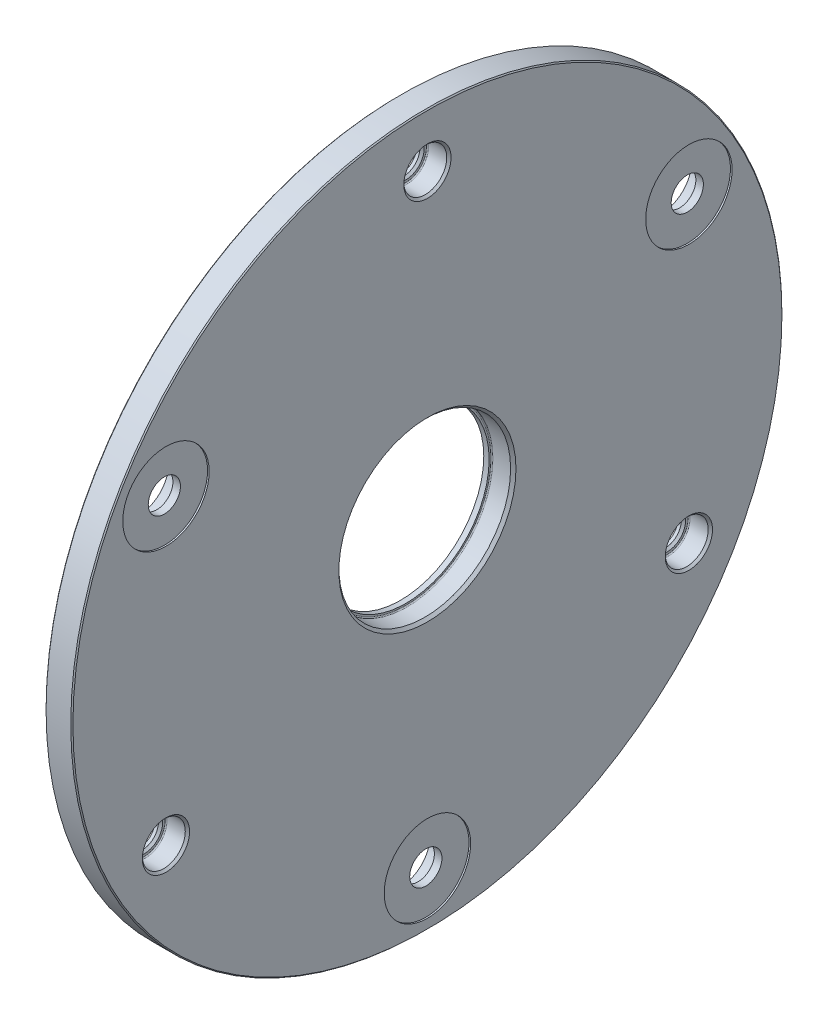
ISO-10303-21;
HEADER;
FILE_DESCRIPTION(('STEP AP214'),'2;1');
FILE_NAME('part.step','',(''),(''),'','','');
FILE_SCHEMA(('AUTOMOTIVE_DESIGN { 1 0 10303 214 1 1 1 1 }'));
ENDSEC;
DATA;
#1=APPLICATION_CONTEXT('core data for automotive mechanical design processes');
#2=APPLICATION_PROTOCOL_DEFINITION('international standard','automotive_design',2000,#1);
#3=PRODUCT_CONTEXT('',#1,'mechanical');
#4=PRODUCT('Part','Part','',(#3));
#5=PRODUCT_RELATED_PRODUCT_CATEGORY('part','',(#4));
#6=PRODUCT_DEFINITION_FORMATION('','',#4);
#7=PRODUCT_DEFINITION_CONTEXT('part definition',#1,'design');
#8=PRODUCT_DEFINITION('design','',#6,#7);
#9=PRODUCT_DEFINITION_SHAPE('','',#8);
#10=(LENGTH_UNIT() NAMED_UNIT(*) SI_UNIT(.MILLI.,.METRE.));
#11=(NAMED_UNIT(*) PLANE_ANGLE_UNIT() SI_UNIT($,.RADIAN.));
#12=(NAMED_UNIT(*) SI_UNIT($,.STERADIAN.) SOLID_ANGLE_UNIT());
#13=UNCERTAINTY_MEASURE_WITH_UNIT(LENGTH_MEASURE(1.E-05),#10,'distance_accuracy_value','');
#14=(GEOMETRIC_REPRESENTATION_CONTEXT(3) GLOBAL_UNCERTAINTY_ASSIGNED_CONTEXT((#13)) GLOBAL_UNIT_ASSIGNED_CONTEXT((#10,
#11,#12)) REPRESENTATION_CONTEXT('',''));
#15=CARTESIAN_POINT('',(0.,0.,0.));
#16=DIRECTION('',(0.,0.,1.));
#17=DIRECTION('',(1.,0.,0.));
#18=AXIS2_PLACEMENT_3D('',#15,#16,#17);
#19=CARTESIAN_POINT('',(-13.4852813742386,-28.1249999999995,48.7139289628749));
#20=DIRECTION('',(1.,0.,0.));
#21=DIRECTION('',(0.,0.,-1.));
#22=AXIS2_PLACEMENT_3D('',#19,#20,#21);
#23=CYLINDRICAL_SURFACE('',#22,3.);
#24=CARTESIAN_POINT('',(-4.39999999999994,-28.1249999999995,48.7139289628749));
#25=DIRECTION('',(1.,0.,0.));
#26=DIRECTION('',(0.,0.,-1.));
#27=AXIS2_PLACEMENT_3D('',#24,#25,#26);
#28=CIRCLE('',#27,3.);
#29=CARTESIAN_POINT('',(-4.39999999999994,-28.1249999999995,45.7139289628749));
#30=VERTEX_POINT('',#29);
#31=EDGE_CURVE('E95',#30,#30,#28,.T.);
#32=ORIENTED_EDGE('',*,*,#31,.T.);
#33=EDGE_LOOP('',(#32));
#34=FACE_BOUND('',#33,.T.);
#35=CARTESIAN_POINT('',(-5.,-28.1249999999995,48.7139289628749));
#36=DIRECTION('',(1.,0.,0.));
#37=DIRECTION('',(0.,0.,-1.));
#38=AXIS2_PLACEMENT_3D('',#35,#36,#37);
#39=CIRCLE('',#38,3.);
#40=CARTESIAN_POINT('',(-5.,-28.1249999999995,45.7139289628749));
#41=VERTEX_POINT('',#40);
#42=EDGE_CURVE('E153',#41,#41,#39,.F.);
#43=ORIENTED_EDGE('',*,*,#42,.T.);
#44=EDGE_LOOP('',(#43));
#45=FACE_BOUND('',#44,.T.);
#46=ADVANCED_FACE('F34',(#34,#45),#23,.F.);
#47=CARTESIAN_POINT('',(-13.4852813742386,-28.1250000000002,-48.7139289628746));
#48=DIRECTION('',(1.,0.,0.));
#49=DIRECTION('',(0.,0.,-1.));
#50=AXIS2_PLACEMENT_3D('',#47,#48,#49);
#51=CYLINDRICAL_SURFACE('',#50,3.);
#52=CARTESIAN_POINT('',(-4.39999999999994,-28.1250000000002,-48.7139289628746));
#53=DIRECTION('',(1.,0.,0.));
#54=DIRECTION('',(0.,0.,-1.));
#55=AXIS2_PLACEMENT_3D('',#52,#53,#54);
#56=CIRCLE('',#55,3.);
#57=CARTESIAN_POINT('',(-4.39999999999994,-28.1250000000002,-51.7139289628746));
#58=VERTEX_POINT('',#57);
#59=EDGE_CURVE('E107',#58,#58,#56,.T.);
#60=ORIENTED_EDGE('',*,*,#59,.T.);
#61=EDGE_LOOP('',(#60));
#62=FACE_BOUND('',#61,.T.);
#63=CARTESIAN_POINT('',(-5.,-28.1250000000002,-48.7139289628746));
#64=DIRECTION('',(1.,0.,0.));
#65=DIRECTION('',(0.,0.,-1.));
#66=AXIS2_PLACEMENT_3D('',#63,#64,#65);
#67=CIRCLE('',#66,3.);
#68=CARTESIAN_POINT('',(-5.,-28.1250000000002,-51.7139289628746));
#69=VERTEX_POINT('',#68);
#70=EDGE_CURVE('E152',#69,#69,#67,.F.);
#71=ORIENTED_EDGE('',*,*,#70,.T.);
#72=EDGE_LOOP('',(#71));
#73=FACE_BOUND('',#72,.T.);
#74=ADVANCED_FACE('F209',(#62,#73),#51,.F.);
#75=CARTESIAN_POINT('',(-13.4852813742386,56.25,0.));
#76=DIRECTION('',(1.,0.,0.));
#77=DIRECTION('',(0.,0.,-1.));
#78=AXIS2_PLACEMENT_3D('',#75,#76,#77);
#79=CYLINDRICAL_SURFACE('',#78,3.);
#80=CARTESIAN_POINT('',(-4.39999999999998,56.25,0.));
#81=DIRECTION('',(1.,0.,0.));
#82=DIRECTION('',(0.,0.,-1.));
#83=AXIS2_PLACEMENT_3D('',#80,#81,#82);
#84=CIRCLE('',#83,3.);
#85=CARTESIAN_POINT('',(-4.39999999999998,56.25,-3.));
#86=VERTEX_POINT('',#85);
#87=EDGE_CURVE('E130',#86,#86,#84,.T.);
#88=ORIENTED_EDGE('',*,*,#87,.T.);
#89=EDGE_LOOP('',(#88));
#90=FACE_BOUND('',#89,.T.);
#91=CARTESIAN_POINT('',(-5.,56.25,0.));
#92=DIRECTION('',(1.,0.,0.));
#93=DIRECTION('',(0.,0.,-1.));
#94=AXIS2_PLACEMENT_3D('',#91,#92,#93);
#95=CIRCLE('',#94,3.);
#96=CARTESIAN_POINT('',(-5.,56.25,-3.));
#97=VERTEX_POINT('',#96);
#98=EDGE_CURVE('E136',#97,#97,#95,.F.);
#99=ORIENTED_EDGE('',*,*,#98,.T.);
#100=EDGE_LOOP('',(#99));
#101=FACE_BOUND('',#100,.T.);
#102=ADVANCED_FACE('F215',(#90,#101),#79,.F.);
#103=CARTESIAN_POINT('',(-5.,0.,0.));
#104=DIRECTION('',(1.,0.,0.));
#105=DIRECTION('',(0.,0.,-1.));
#106=AXIS2_PLACEMENT_3D('',#103,#104,#105);
#107=CYLINDRICAL_SURFACE('',#106,66.25);
#108=CARTESIAN_POINT('',(-0.20000000000002,0.,0.));
#109=DIRECTION('',(1.,0.,0.));
#110=DIRECTION('',(0.,0.,-1.));
#111=AXIS2_PLACEMENT_3D('',#108,#109,#110);
#112=CIRCLE('',#111,66.25);
#113=CARTESIAN_POINT('',(-0.20000000000002,0.,-66.25));
#114=VERTEX_POINT('',#113);
#115=EDGE_CURVE('E42',#114,#114,#112,.F.);
#116=ORIENTED_EDGE('',*,*,#115,.T.);
#117=EDGE_LOOP('',(#116));
#118=FACE_BOUND('',#117,.T.);
#119=CARTESIAN_POINT('',(-4.80000000000001,0.,0.));
#120=DIRECTION('',(1.,0.,0.));
#121=DIRECTION('',(0.,0.,-1.));
#122=AXIS2_PLACEMENT_3D('',#119,#120,#121);
#123=CIRCLE('',#122,66.25);
#124=CARTESIAN_POINT('',(-4.80000000000001,0.,-66.25));
#125=VERTEX_POINT('',#124);
#126=EDGE_CURVE('E46',#125,#125,#123,.T.);
#127=ORIENTED_EDGE('',*,*,#126,.T.);
#128=EDGE_LOOP('',(#127));
#129=FACE_BOUND('',#128,.T.);
#130=ADVANCED_FACE('F255',(#118,#129),#107,.T.);
#131=CARTESIAN_POINT('',(-5.,0.,0.));
#132=DIRECTION('',(1.,0.,0.));
#133=DIRECTION('',(0.,0.,-1.));
#134=AXIS2_PLACEMENT_3D('',#131,#132,#133);
#135=PLANE('',#134);
#136=CARTESIAN_POINT('',(-5.,0.,0.));
#137=DIRECTION('',(1.,0.,0.));
#138=DIRECTION('',(0.,0.,-1.));
#139=AXIS2_PLACEMENT_3D('',#136,#137,#138);
#140=CIRCLE('',#139,66.05);
#141=CARTESIAN_POINT('',(-5.,0.,-66.05));
#142=VERTEX_POINT('',#141);
#143=EDGE_CURVE('E11',#142,#142,#140,.F.);
#144=ORIENTED_EDGE('',*,*,#143,.T.);
#145=EDGE_LOOP('',(#144));
#146=FACE_BOUND('',#145,.T.);
#147=CARTESIAN_POINT('',(-5.,28.1250000000004,48.7139289628745));
#148=DIRECTION('',(-1.,0.,0.));
#149=DIRECTION('',(0.,0.,1.));
#150=AXIS2_PLACEMENT_3D('',#147,#148,#149);
#151=CIRCLE('',#150,5.5);
#152=CARTESIAN_POINT('',(-5.,28.1250000000004,54.2139289628745));
#153=VERTEX_POINT('',#152);
#154=EDGE_CURVE('E181',#153,#153,#151,.T.);
#155=ORIENTED_EDGE('',*,*,#154,.F.);
#156=EDGE_LOOP('',(#155));
#157=FACE_BOUND('',#156,.T.);
#158=CARTESIAN_POINT('',(-5.,-56.25,1.73472347597681E-13));
#159=DIRECTION('',(-1.,0.,0.));
#160=DIRECTION('',(0.,0.,1.));
#161=AXIS2_PLACEMENT_3D('',#158,#159,#160);
#162=CIRCLE('',#161,5.5);
#163=CARTESIAN_POINT('',(-5.,-56.25,5.50000000000017));
#164=VERTEX_POINT('',#163);
#165=EDGE_CURVE('E71',#164,#164,#162,.T.);
#166=ORIENTED_EDGE('',*,*,#165,.F.);
#167=EDGE_LOOP('',(#166));
#168=FACE_BOUND('',#167,.T.);
#169=ORIENTED_EDGE('',*,*,#70,.F.);
#170=EDGE_LOOP('',(#169));
#171=FACE_BOUND('',#170,.T.);
#172=ORIENTED_EDGE('',*,*,#42,.F.);
#173=EDGE_LOOP('',(#172));
#174=FACE_BOUND('',#173,.T.);
#175=CARTESIAN_POINT('',(-5.,28.1250000000001,-48.7139289628746));
#176=DIRECTION('',(-1.,0.,0.));
#177=DIRECTION('',(0.,0.,1.));
#178=AXIS2_PLACEMENT_3D('',#175,#176,#177);
#179=CIRCLE('',#178,5.5);
#180=CARTESIAN_POINT('',(-5.,28.1250000000001,-43.2139289628746));
#181=VERTEX_POINT('',#180);
#182=EDGE_CURVE('E149',#181,#181,#179,.T.);
#183=ORIENTED_EDGE('',*,*,#182,.F.);
#184=EDGE_LOOP('',(#183));
#185=FACE_BOUND('',#184,.T.);
#186=ORIENTED_EDGE('',*,*,#98,.F.);
#187=EDGE_LOOP('',(#186));
#188=FACE_BOUND('',#187,.T.);
#189=CARTESIAN_POINT('',(-5.,0.,0.));
#190=DIRECTION('',(1.,0.,0.));
#191=DIRECTION('',(0.,0.,-1.));
#192=AXIS2_PLACEMENT_3D('',#189,#190,#191);
#193=CIRCLE('',#192,15.5);
#194=CARTESIAN_POINT('',(-5.,0.,-15.5));
#195=VERTEX_POINT('',#194);
#196=EDGE_CURVE('E185',#195,#195,#193,.T.);
#197=ORIENTED_EDGE('',*,*,#196,.T.);
#198=EDGE_LOOP('',(#197));
#199=FACE_BOUND('',#198,.T.);
#200=ADVANCED_FACE('F261',(#146,#157,#168,#171,#174,#185,#188,#199),#135,.F.);
#201=CARTESIAN_POINT('',(0.,0.,0.));
#202=DIRECTION('',(1.,0.,0.));
#203=DIRECTION('',(0.,0.,-1.));
#204=AXIS2_PLACEMENT_3D('',#201,#202,#203);
#205=PLANE('',#204);
#206=CARTESIAN_POINT('',(0.,0.,0.));
#207=DIRECTION('',(1.,0.,0.));
#208=DIRECTION('',(0.,0.,-1.));
#209=AXIS2_PLACEMENT_3D('',#206,#207,#208);
#210=CIRCLE('',#209,66.05);
#211=CARTESIAN_POINT('',(0.,0.,-66.05));
#212=VERTEX_POINT('',#211);
#213=EDGE_CURVE('E50',#212,#212,#210,.T.);
#214=ORIENTED_EDGE('',*,*,#213,.T.);
#215=EDGE_LOOP('',(#214));
#216=FACE_BOUND('',#215,.T.);
#217=CARTESIAN_POINT('',(0.,0.,0.));
#218=DIRECTION('',(1.,0.,0.));
#219=DIRECTION('',(0.,0.,-1.));
#220=AXIS2_PLACEMENT_3D('',#217,#218,#219);
#221=CIRCLE('',#220,16.5);
#222=CARTESIAN_POINT('',(0.,0.,-16.5));
#223=VERTEX_POINT('',#222);
#224=EDGE_CURVE('E55',#223,#223,#221,.F.);
#225=ORIENTED_EDGE('',*,*,#224,.T.);
#226=EDGE_LOOP('',(#225));
#227=FACE_BOUND('',#226,.T.);
#228=CARTESIAN_POINT('',(0.,-56.25,1.73472347597681E-13));
#229=DIRECTION('',(1.,0.,0.));
#230=DIRECTION('',(0.,-0.866025403784436,0.500000000000004));
#231=AXIS2_PLACEMENT_3D('',#228,#229,#230);
#232=CIRCLE('',#231,8.05000000000001);
#233=CARTESIAN_POINT('',(0.,-63.2215045004647,4.02500000000021));
#234=VERTEX_POINT('',#233);
#235=EDGE_CURVE('E164',#234,#234,#232,.T.);
#236=ORIENTED_EDGE('',*,*,#235,.F.);
#237=EDGE_LOOP('',(#236));
#238=FACE_BOUND('',#237,.T.);
#239=CARTESIAN_POINT('',(0.,28.1250000000004,48.7139289628745));
#240=DIRECTION('',(1.,0.,0.));
#241=DIRECTION('',(0.,0.866025403784443,0.499999999999992));
#242=AXIS2_PLACEMENT_3D('',#239,#240,#241);
#243=CIRCLE('',#242,8.05000000000001);
#244=CARTESIAN_POINT('',(0.,35.0965045004652,52.7389289628744));
#245=VERTEX_POINT('',#244);
#246=EDGE_CURVE('E76',#245,#245,#243,.T.);
#247=ORIENTED_EDGE('',*,*,#246,.F.);
#248=EDGE_LOOP('',(#247));
#249=FACE_BOUND('',#248,.T.);
#250=CARTESIAN_POINT('',(0.,-28.1249999999995,48.7139289628749));
#251=DIRECTION('',(1.,0.,0.));
#252=DIRECTION('',(0.,0.,-1.));
#253=AXIS2_PLACEMENT_3D('',#250,#251,#252);
#254=CIRCLE('',#253,4.39999999999999);
#255=CARTESIAN_POINT('',(0.,-28.1249999999995,44.3139289628749));
#256=VERTEX_POINT('',#255);
#257=EDGE_CURVE('E89',#256,#256,#254,.F.);
#258=ORIENTED_EDGE('',*,*,#257,.T.);
#259=EDGE_LOOP('',(#258));
#260=FACE_BOUND('',#259,.T.);
#261=CARTESIAN_POINT('',(0.,-28.1250000000002,-48.7139289628746));
#262=DIRECTION('',(1.,0.,0.));
#263=DIRECTION('',(0.,0.,-1.));
#264=AXIS2_PLACEMENT_3D('',#261,#262,#263);
#265=CIRCLE('',#264,4.39999999999994);
#266=CARTESIAN_POINT('',(0.,-28.1250000000002,-53.1139289628745));
#267=VERTEX_POINT('',#266);
#268=EDGE_CURVE('E101',#267,#267,#265,.F.);
#269=ORIENTED_EDGE('',*,*,#268,.T.);
#270=EDGE_LOOP('',(#269));
#271=FACE_BOUND('',#270,.T.);
#272=CARTESIAN_POINT('',(0.,28.1250000000001,-48.7139289628746));
#273=DIRECTION('',(1.,0.,0.));
#274=DIRECTION('',(0.,0.,-1.));
#275=AXIS2_PLACEMENT_3D('',#272,#273,#274);
#276=CIRCLE('',#275,8.05000000000001);
#277=CARTESIAN_POINT('',(0.,28.1250000000001,-56.7639289628746));
#278=VERTEX_POINT('',#277);
#279=EDGE_CURVE('E117',#278,#278,#276,.T.);
#280=ORIENTED_EDGE('',*,*,#279,.F.);
#281=EDGE_LOOP('',(#280));
#282=FACE_BOUND('',#281,.T.);
#283=CARTESIAN_POINT('',(0.,56.25,0.));
#284=DIRECTION('',(1.,0.,0.));
#285=DIRECTION('',(0.,0.,-1.));
#286=AXIS2_PLACEMENT_3D('',#283,#284,#285);
#287=CIRCLE('',#286,4.39999999999993);
#288=CARTESIAN_POINT('',(0.,56.25,-4.39999999999993));
#289=VERTEX_POINT('',#288);
#290=EDGE_CURVE('E124',#289,#289,#287,.F.);
#291=ORIENTED_EDGE('',*,*,#290,.T.);
#292=EDGE_LOOP('',(#291));
#293=FACE_BOUND('',#292,.T.);
#294=ADVANCED_FACE('F259',(#216,#227,#238,#249,#260,#271,#282,#293),#205,.T.);
#295=CARTESIAN_POINT('',(-5.,0.,0.));
#296=DIRECTION('',(1.,0.,0.));
#297=DIRECTION('',(0.,0.,-1.));
#298=AXIS2_PLACEMENT_3D('',#295,#296,#297);
#299=CYLINDRICAL_SURFACE('',#298,16.);
#300=CARTESIAN_POINT('',(-0.500000000000014,0.,0.));
#301=DIRECTION('',(1.,0.,0.));
#302=DIRECTION('',(0.,0.,-1.));
#303=AXIS2_PLACEMENT_3D('',#300,#301,#302);
#304=CIRCLE('',#303,16.);
#305=CARTESIAN_POINT('',(-0.500000000000014,0.,-16.));
#306=VERTEX_POINT('',#305);
#307=EDGE_CURVE('E58',#306,#306,#304,.T.);
#308=ORIENTED_EDGE('',*,*,#307,.T.);
#309=EDGE_LOOP('',(#308));
#310=FACE_BOUND('',#309,.T.);
#311=CARTESIAN_POINT('',(-3.8,0.,0.));
#312=DIRECTION('',(1.,0.,0.));
#313=DIRECTION('',(0.,0.,-1.));
#314=AXIS2_PLACEMENT_3D('',#311,#312,#313);
#315=CIRCLE('',#314,16.);
#316=CARTESIAN_POINT('',(-3.8,0.,-16.));
#317=VERTEX_POINT('',#316);
#318=EDGE_CURVE('E61',#317,#317,#315,.F.);
#319=ORIENTED_EDGE('',*,*,#318,.T.);
#320=EDGE_LOOP('',(#319));
#321=FACE_BOUND('',#320,.T.);
#322=ADVANCED_FACE('F251',(#310,#321),#299,.F.);
#323=CARTESIAN_POINT('',(-16.3137084989848,56.25,0.));
#324=DIRECTION('',(1.,0.,0.));
#325=DIRECTION('',(0.,0.,-1.));
#326=AXIS2_PLACEMENT_3D('',#323,#324,#325);
#327=CYLINDRICAL_SURFACE('',#326,4.);
#328=CARTESIAN_POINT('',(-3.8,56.25,0.));
#329=DIRECTION('',(1.,0.,0.));
#330=DIRECTION('',(0.,0.,-1.));
#331=AXIS2_PLACEMENT_3D('',#328,#329,#330);
#332=CIRCLE('',#331,4.);
#333=CARTESIAN_POINT('',(-3.8,56.25,-4.));
#334=VERTEX_POINT('',#333);
#335=EDGE_CURVE('E121',#334,#334,#332,.F.);
#336=ORIENTED_EDGE('',*,*,#335,.T.);
#337=EDGE_LOOP('',(#336));
#338=FACE_BOUND('',#337,.T.);
#339=CARTESIAN_POINT('',(-0.399999999999946,56.25,0.));
#340=DIRECTION('',(1.,0.,0.));
#341=DIRECTION('',(0.,0.,-1.));
#342=AXIS2_PLACEMENT_3D('',#339,#340,#341);
#343=CIRCLE('',#342,4.);
#344=CARTESIAN_POINT('',(-0.399999999999946,56.25,-4.));
#345=VERTEX_POINT('',#344);
#346=EDGE_CURVE('E127',#345,#345,#343,.T.);
#347=ORIENTED_EDGE('',*,*,#346,.T.);
#348=EDGE_LOOP('',(#347));
#349=FACE_BOUND('',#348,.T.);
#350=ADVANCED_FACE('F247',(#338,#349),#327,.F.);
#351=CARTESIAN_POINT('',(-4.,0.,0.));
#352=DIRECTION('',(1.,0.,0.));
#353=DIRECTION('',(0.,0.,-1.));
#354=AXIS2_PLACEMENT_3D('',#351,#352,#353);
#355=PLANE('',#354);
#356=CARTESIAN_POINT('',(-4.,56.25,0.));
#357=DIRECTION('',(1.,0.,0.));
#358=DIRECTION('',(0.,0.,-1.));
#359=AXIS2_PLACEMENT_3D('',#356,#357,#358);
#360=CIRCLE('',#359,3.8);
#361=CARTESIAN_POINT('',(-4.,56.25,-3.8));
#362=VERTEX_POINT('',#361);
#363=EDGE_CURVE('E113',#362,#362,#360,.T.);
#364=ORIENTED_EDGE('',*,*,#363,.T.);
#365=EDGE_LOOP('',(#364));
#366=FACE_BOUND('',#365,.T.);
#367=CARTESIAN_POINT('',(-4.,56.25,0.));
#368=DIRECTION('',(1.,0.,0.));
#369=DIRECTION('',(0.,0.,-1.));
#370=AXIS2_PLACEMENT_3D('',#367,#368,#369);
#371=CIRCLE('',#370,3.39999999999999);
#372=CARTESIAN_POINT('',(-4.,56.25,-3.39999999999999));
#373=VERTEX_POINT('',#372);
#374=EDGE_CURVE('E133',#373,#373,#371,.F.);
#375=ORIENTED_EDGE('',*,*,#374,.T.);
#376=EDGE_LOOP('',(#375));
#377=FACE_BOUND('',#376,.T.);
#378=ADVANCED_FACE('F243',(#366,#377),#355,.T.);
#379=CARTESIAN_POINT('',(-4.,56.25,0.));
#380=DIRECTION('',(1.,0.,0.));
#381=DIRECTION('',(0.,0.,-1.));
#382=AXIS2_PLACEMENT_3D('',#379,#380,#381);
#383=CONICAL_SURFACE('',#382,3.39999999999999,0.785398163397459);
#384=ORIENTED_EDGE('',*,*,#87,.F.);
#385=EDGE_LOOP('',(#384));
#386=FACE_BOUND('',#385,.T.);
#387=ORIENTED_EDGE('',*,*,#374,.F.);
#388=EDGE_LOOP('',(#387));
#389=FACE_BOUND('',#388,.T.);
#390=ADVANCED_FACE('F246',(#386,#389),#383,.F.);
#391=CARTESIAN_POINT('',(-0.399999999999946,56.25,0.));
#392=DIRECTION('',(1.,0.,0.));
#393=DIRECTION('',(0.,0.,-1.));
#394=AXIS2_PLACEMENT_3D('',#391,#392,#393);
#395=CONICAL_SURFACE('',#394,4.,0.78539816339743);
#396=ORIENTED_EDGE('',*,*,#290,.F.);
#397=EDGE_LOOP('',(#396));
#398=FACE_BOUND('',#397,.T.);
#399=ORIENTED_EDGE('',*,*,#346,.F.);
#400=EDGE_LOOP('',(#399));
#401=FACE_BOUND('',#400,.T.);
#402=ADVANCED_FACE('F275',(#398,#401),#395,.F.);
#403=CARTESIAN_POINT('',(-3.8,56.25,0.));
#404=DIRECTION('',(1.,0.,0.));
#405=DIRECTION('',(0.,0.,-1.));
#406=AXIS2_PLACEMENT_3D('',#403,#404,#405);
#407=TOROIDAL_SURFACE('',#406,3.8,0.2);
#408=ORIENTED_EDGE('',*,*,#363,.F.);
#409=EDGE_LOOP('',(#408));
#410=FACE_BOUND('',#409,.T.);
#411=ORIENTED_EDGE('',*,*,#335,.F.);
#412=EDGE_LOOP('',(#411));
#413=FACE_BOUND('',#412,.T.);
#414=ADVANCED_FACE('F241',(#410,#413),#407,.F.);
#415=CARTESIAN_POINT('',(-0.3,28.1250000000001,-48.7139289628746));
#416=DIRECTION('',(1.,0.,0.));
#417=DIRECTION('',(0.,0.,-1.));
#418=AXIS2_PLACEMENT_3D('',#415,#416,#417);
#419=CYLINDRICAL_SURFACE('',#418,8.05000000000001);
#420=CARTESIAN_POINT('',(-0.3,28.1250000000001,-48.7139289628746));
#421=DIRECTION('',(1.,0.,0.));
#422=DIRECTION('',(0.,0.,-1.));
#423=AXIS2_PLACEMENT_3D('',#420,#421,#422);
#424=CIRCLE('',#423,8.05000000000001);
#425=CARTESIAN_POINT('',(-0.3,28.1250000000001,-56.7639289628746));
#426=VERTEX_POINT('',#425);
#427=EDGE_CURVE('E139',#426,#426,#424,.T.);
#428=ORIENTED_EDGE('',*,*,#427,.F.);
#429=EDGE_LOOP('',(#428));
#430=FACE_BOUND('',#429,.T.);
#431=ORIENTED_EDGE('',*,*,#279,.T.);
#432=EDGE_LOOP('',(#431));
#433=FACE_BOUND('',#432,.T.);
#434=ADVANCED_FACE('F237',(#430,#433),#419,.F.);
#435=CARTESIAN_POINT('',(-0.3,0.,0.));
#436=DIRECTION('',(1.,0.,0.));
#437=DIRECTION('',(0.,0.,-1.));
#438=AXIS2_PLACEMENT_3D('',#435,#436,#437);
#439=PLANE('',#438);
#440=CARTESIAN_POINT('',(-0.3,28.1250000000001,-48.7139289628746));
#441=DIRECTION('',(1.,0.,0.));
#442=DIRECTION('',(0.,0.,-1.));
#443=AXIS2_PLACEMENT_3D('',#440,#441,#442);
#444=CIRCLE('',#443,3.);
#445=CARTESIAN_POINT('',(-0.3,28.1250000000001,-51.7139289628746));
#446=VERTEX_POINT('',#445);
#447=EDGE_CURVE('E114',#446,#446,#444,.T.);
#448=ORIENTED_EDGE('',*,*,#447,.F.);
#449=EDGE_LOOP('',(#448));
#450=FACE_BOUND('',#449,.T.);
#451=ORIENTED_EDGE('',*,*,#427,.T.);
#452=EDGE_LOOP('',(#451));
#453=FACE_BOUND('',#452,.T.);
#454=ADVANCED_FACE('F233',(#450,#453),#439,.T.);
#455=CARTESIAN_POINT('',(-5.,28.1250000000001,-48.7139289628746));
#456=DIRECTION('',(-1.,0.,0.));
#457=DIRECTION('',(0.,0.,1.));
#458=AXIS2_PLACEMENT_3D('',#455,#456,#457);
#459=CYLINDRICAL_SURFACE('',#458,3.);
#460=ORIENTED_EDGE('',*,*,#447,.T.);
#461=EDGE_LOOP('',(#460));
#462=FACE_BOUND('',#461,.T.);
#463=CARTESIAN_POINT('',(-1.7,28.1250000000001,-48.7139289628746));
#464=DIRECTION('',(-1.,0.,0.));
#465=DIRECTION('',(0.,0.,1.));
#466=AXIS2_PLACEMENT_3D('',#463,#464,#465);
#467=CIRCLE('',#466,3.);
#468=CARTESIAN_POINT('',(-1.7,28.1250000000001,-45.7139289628746));
#469=VERTEX_POINT('',#468);
#470=EDGE_CURVE('E118',#469,#469,#467,.T.);
#471=ORIENTED_EDGE('',*,*,#470,.T.);
#472=EDGE_LOOP('',(#471));
#473=FACE_BOUND('',#472,.T.);
#474=ADVANCED_FACE('F229',(#462,#473),#459,.F.);
#475=CARTESIAN_POINT('',(-1.7,31.1250000000001,-48.7139289628746));
#476=DIRECTION('',(1.,0.,0.));
#477=DIRECTION('',(0.,0.,-1.));
#478=AXIS2_PLACEMENT_3D('',#475,#476,#477);
#479=PLANE('',#478);
#480=ORIENTED_EDGE('',*,*,#470,.F.);
#481=EDGE_LOOP('',(#480));
#482=FACE_BOUND('',#481,.T.);
#483=CARTESIAN_POINT('',(-1.7,28.1250000000001,-48.7139289628746));
#484=DIRECTION('',(-1.,0.,0.));
#485=DIRECTION('',(0.,0.,1.));
#486=AXIS2_PLACEMENT_3D('',#483,#484,#485);
#487=CIRCLE('',#486,5.5);
#488=CARTESIAN_POINT('',(-1.7,28.1250000000001,-43.2139289628746));
#489=VERTEX_POINT('',#488);
#490=EDGE_CURVE('E146',#489,#489,#487,.T.);
#491=ORIENTED_EDGE('',*,*,#490,.T.);
#492=EDGE_LOOP('',(#491));
#493=FACE_BOUND('',#492,.T.);
#494=ADVANCED_FACE('F225',(#482,#493),#479,.F.);
#495=CARTESIAN_POINT('',(-5.,28.1250000000001,-48.7139289628746));
#496=DIRECTION('',(-1.,0.,0.));
#497=DIRECTION('',(0.,0.,1.));
#498=AXIS2_PLACEMENT_3D('',#495,#496,#497);
#499=CYLINDRICAL_SURFACE('',#498,5.5);
#500=ORIENTED_EDGE('',*,*,#490,.F.);
#501=EDGE_LOOP('',(#500));
#502=FACE_BOUND('',#501,.T.);
#503=ORIENTED_EDGE('',*,*,#182,.T.);
#504=EDGE_LOOP('',(#503));
#505=FACE_BOUND('',#504,.T.);
#506=ADVANCED_FACE('F221',(#502,#505),#499,.F.);
#507=CARTESIAN_POINT('',(-16.3137084989848,-28.1250000000002,-48.7139289628746));
#508=DIRECTION('',(1.,0.,0.));
#509=DIRECTION('',(0.,0.,-1.));
#510=AXIS2_PLACEMENT_3D('',#507,#508,#509);
#511=CYLINDRICAL_SURFACE('',#510,4.);
#512=CARTESIAN_POINT('',(-3.8,-28.1250000000002,-48.7139289628746));
#513=DIRECTION('',(1.,0.,0.));
#514=DIRECTION('',(0.,0.,-1.));
#515=AXIS2_PLACEMENT_3D('',#512,#513,#514);
#516=CIRCLE('',#515,4.);
#517=CARTESIAN_POINT('',(-3.8,-28.1250000000002,-52.7139289628746));
#518=VERTEX_POINT('',#517);
#519=EDGE_CURVE('E86',#518,#518,#516,.F.);
#520=ORIENTED_EDGE('',*,*,#519,.T.);
#521=EDGE_LOOP('',(#520));
#522=FACE_BOUND('',#521,.T.);
#523=CARTESIAN_POINT('',(-0.399999999999946,-28.1250000000002,-48.7139289628746));
#524=DIRECTION('',(1.,0.,0.));
#525=DIRECTION('',(0.,0.,-1.));
#526=AXIS2_PLACEMENT_3D('',#523,#524,#525);
#527=CIRCLE('',#526,4.);
#528=CARTESIAN_POINT('',(-0.399999999999946,-28.1250000000002,-52.7139289628746));
#529=VERTEX_POINT('',#528);
#530=EDGE_CURVE('E104',#529,#529,#527,.T.);
#531=ORIENTED_EDGE('',*,*,#530,.T.);
#532=EDGE_LOOP('',(#531));
#533=FACE_BOUND('',#532,.T.);
#534=ADVANCED_FACE('F224',(#522,#533),#511,.F.);
#535=CARTESIAN_POINT('',(-4.,0.,0.));
#536=DIRECTION('',(1.,0.,0.));
#537=DIRECTION('',(0.,0.,-1.));
#538=AXIS2_PLACEMENT_3D('',#535,#536,#537);
#539=PLANE('',#538);
#540=CARTESIAN_POINT('',(-4.,-28.1250000000002,-48.7139289628746));
#541=DIRECTION('',(1.,0.,0.));
#542=DIRECTION('',(0.,0.,-1.));
#543=AXIS2_PLACEMENT_3D('',#540,#541,#542);
#544=CIRCLE('',#543,3.8);
#545=CARTESIAN_POINT('',(-4.,-28.1250000000002,-52.5139289628746));
#546=VERTEX_POINT('',#545);
#547=EDGE_CURVE('E83',#546,#546,#544,.T.);
#548=ORIENTED_EDGE('',*,*,#547,.T.);
#549=EDGE_LOOP('',(#548));
#550=FACE_BOUND('',#549,.T.);
#551=CARTESIAN_POINT('',(-4.,-28.1250000000002,-48.7139289628746));
#552=DIRECTION('',(1.,0.,0.));
#553=DIRECTION('',(0.,0.,-1.));
#554=AXIS2_PLACEMENT_3D('',#551,#552,#553);
#555=CIRCLE('',#554,3.3999999999999);
#556=CARTESIAN_POINT('',(-4.,-28.1250000000002,-52.1139289628745));
#557=VERTEX_POINT('',#556);
#558=EDGE_CURVE('E110',#557,#557,#555,.F.);
#559=ORIENTED_EDGE('',*,*,#558,.T.);
#560=EDGE_LOOP('',(#559));
#561=FACE_BOUND('',#560,.T.);
#562=ADVANCED_FACE('F366',(#550,#561),#539,.T.);
#563=CARTESIAN_POINT('',(-16.3137084989848,-28.1249999999995,48.7139289628749));
#564=DIRECTION('',(1.,0.,0.));
#565=DIRECTION('',(0.,0.,-1.));
#566=AXIS2_PLACEMENT_3D('',#563,#564,#565);
#567=CYLINDRICAL_SURFACE('',#566,4.);
#568=CARTESIAN_POINT('',(-3.8,-28.1249999999995,48.7139289628749));
#569=DIRECTION('',(1.,0.,0.));
#570=DIRECTION('',(0.,0.,-1.));
#571=AXIS2_PLACEMENT_3D('',#568,#569,#570);
#572=CIRCLE('',#571,4.);
#573=CARTESIAN_POINT('',(-3.8,-28.1249999999995,44.7139289628749));
#574=VERTEX_POINT('',#573);
#575=EDGE_CURVE('E80',#574,#574,#572,.F.);
#576=ORIENTED_EDGE('',*,*,#575,.T.);
#577=EDGE_LOOP('',(#576));
#578=FACE_BOUND('',#577,.T.);
#579=CARTESIAN_POINT('',(-0.400000000000001,-28.1249999999995,48.7139289628749));
#580=DIRECTION('',(1.,0.,0.));
#581=DIRECTION('',(0.,0.,-1.));
#582=AXIS2_PLACEMENT_3D('',#579,#580,#581);
#583=CIRCLE('',#582,4.);
#584=CARTESIAN_POINT('',(-0.400000000000001,-28.1249999999995,44.7139289628749));
#585=VERTEX_POINT('',#584);
#586=EDGE_CURVE('E92',#585,#585,#583,.T.);
#587=ORIENTED_EDGE('',*,*,#586,.T.);
#588=EDGE_LOOP('',(#587));
#589=FACE_BOUND('',#588,.T.);
#590=ADVANCED_FACE('F372',(#578,#589),#567,.F.);
#591=CARTESIAN_POINT('',(-4.,0.,0.));
#592=DIRECTION('',(1.,0.,0.));
#593=DIRECTION('',(0.,0.,-1.));
#594=AXIS2_PLACEMENT_3D('',#591,#592,#593);
#595=PLANE('',#594);
#596=CARTESIAN_POINT('',(-4.,-28.1249999999995,48.7139289628749));
#597=DIRECTION('',(1.,0.,0.));
#598=DIRECTION('',(0.,0.,-1.));
#599=AXIS2_PLACEMENT_3D('',#596,#597,#598);
#600=CIRCLE('',#599,3.8);
#601=CARTESIAN_POINT('',(-4.,-28.1249999999995,44.9139289628749));
#602=VERTEX_POINT('',#601);
#603=EDGE_CURVE('E67',#602,#602,#600,.T.);
#604=ORIENTED_EDGE('',*,*,#603,.T.);
#605=EDGE_LOOP('',(#604));
#606=FACE_BOUND('',#605,.T.);
#607=CARTESIAN_POINT('',(-4.,-28.1249999999995,48.7139289628749));
#608=DIRECTION('',(1.,0.,0.));
#609=DIRECTION('',(0.,0.,-1.));
#610=AXIS2_PLACEMENT_3D('',#607,#608,#609);
#611=CIRCLE('',#610,3.3999999999999);
#612=CARTESIAN_POINT('',(-4.,-28.1249999999995,45.313928962875));
#613=VERTEX_POINT('',#612);
#614=EDGE_CURVE('E98',#613,#613,#611,.F.);
#615=ORIENTED_EDGE('',*,*,#614,.T.);
#616=EDGE_LOOP('',(#615));
#617=FACE_BOUND('',#616,.T.);
#618=ADVANCED_FACE('F293',(#606,#617),#595,.T.);
#619=CARTESIAN_POINT('',(-4.,-28.1250000000002,-48.7139289628746));
#620=DIRECTION('',(1.,0.,0.));
#621=DIRECTION('',(0.,0.,-1.));
#622=AXIS2_PLACEMENT_3D('',#619,#620,#621);
#623=CONICAL_SURFACE('',#622,3.3999999999999,0.785398163397401);
#624=ORIENTED_EDGE('',*,*,#59,.F.);
#625=EDGE_LOOP('',(#624));
#626=FACE_BOUND('',#625,.T.);
#627=ORIENTED_EDGE('',*,*,#558,.F.);
#628=EDGE_LOOP('',(#627));
#629=FACE_BOUND('',#628,.T.);
#630=ADVANCED_FACE('F286',(#626,#629),#623,.F.);
#631=CARTESIAN_POINT('',(-0.399999999999946,-28.1250000000002,-48.7139289628746));
#632=DIRECTION('',(1.,0.,0.));
#633=DIRECTION('',(0.,0.,-1.));
#634=AXIS2_PLACEMENT_3D('',#631,#632,#633);
#635=CONICAL_SURFACE('',#634,4.,0.785398163397444);
#636=ORIENTED_EDGE('',*,*,#268,.F.);
#637=EDGE_LOOP('',(#636));
#638=FACE_BOUND('',#637,.T.);
#639=ORIENTED_EDGE('',*,*,#530,.F.);
#640=EDGE_LOOP('',(#639));
#641=FACE_BOUND('',#640,.T.);
#642=ADVANCED_FACE('F292',(#638,#641),#635,.F.);
#643=CARTESIAN_POINT('',(-4.,-28.1249999999995,48.7139289628749));
#644=DIRECTION('',(1.,0.,0.));
#645=DIRECTION('',(0.,0.,-1.));
#646=AXIS2_PLACEMENT_3D('',#643,#644,#645);
#647=CONICAL_SURFACE('',#646,3.3999999999999,0.785398163397401);
#648=ORIENTED_EDGE('',*,*,#31,.F.);
#649=EDGE_LOOP('',(#648));
#650=FACE_BOUND('',#649,.T.);
#651=ORIENTED_EDGE('',*,*,#614,.F.);
#652=EDGE_LOOP('',(#651));
#653=FACE_BOUND('',#652,.T.);
#654=ADVANCED_FACE('F300',(#650,#653),#647,.F.);
#655=CARTESIAN_POINT('',(-0.400000000000001,-28.1249999999995,48.7139289628749));
#656=DIRECTION('',(1.,0.,0.));
#657=DIRECTION('',(0.,0.,-1.));
#658=AXIS2_PLACEMENT_3D('',#655,#656,#657);
#659=CONICAL_SURFACE('',#658,4.,0.785398163397435);
#660=ORIENTED_EDGE('',*,*,#257,.F.);
#661=EDGE_LOOP('',(#660));
#662=FACE_BOUND('',#661,.T.);
#663=ORIENTED_EDGE('',*,*,#586,.F.);
#664=EDGE_LOOP('',(#663));
#665=FACE_BOUND('',#664,.T.);
#666=ADVANCED_FACE('F307',(#662,#665),#659,.F.);
#667=CARTESIAN_POINT('',(-3.8,-28.1250000000002,-48.7139289628746));
#668=DIRECTION('',(1.,0.,0.));
#669=DIRECTION('',(0.,0.,-1.));
#670=AXIS2_PLACEMENT_3D('',#667,#668,#669);
#671=TOROIDAL_SURFACE('',#670,3.8,0.2);
#672=ORIENTED_EDGE('',*,*,#547,.F.);
#673=EDGE_LOOP('',(#672));
#674=FACE_BOUND('',#673,.T.);
#675=ORIENTED_EDGE('',*,*,#519,.F.);
#676=EDGE_LOOP('',(#675));
#677=FACE_BOUND('',#676,.T.);
#678=ADVANCED_FACE('F314',(#674,#677),#671,.F.);
#679=CARTESIAN_POINT('',(-3.8,-28.1249999999995,48.7139289628749));
#680=DIRECTION('',(1.,0.,0.));
#681=DIRECTION('',(0.,0.,-1.));
#682=AXIS2_PLACEMENT_3D('',#679,#680,#681);
#683=TOROIDAL_SURFACE('',#682,3.8,0.2);
#684=ORIENTED_EDGE('',*,*,#603,.F.);
#685=EDGE_LOOP('',(#684));
#686=FACE_BOUND('',#685,.T.);
#687=ORIENTED_EDGE('',*,*,#575,.F.);
#688=EDGE_LOOP('',(#687));
#689=FACE_BOUND('',#688,.T.);
#690=ADVANCED_FACE('F318',(#686,#689),#683,.F.);
#691=CARTESIAN_POINT('',(-0.3,28.1250000000004,48.7139289628745));
#692=DIRECTION('',(1.,0.,0.));
#693=DIRECTION('',(0.,0.,-1.));
#694=AXIS2_PLACEMENT_3D('',#691,#692,#693);
#695=CYLINDRICAL_SURFACE('',#694,8.05000000000001);
#696=CARTESIAN_POINT('',(-0.3,28.1250000000004,48.7139289628745));
#697=DIRECTION('',(1.,0.,0.));
#698=DIRECTION('',(0.,0.866025403784443,0.499999999999992));
#699=AXIS2_PLACEMENT_3D('',#696,#697,#698);
#700=CIRCLE('',#699,8.05000000000001);
#701=CARTESIAN_POINT('',(-0.3,35.0965045004652,52.7389289628744));
#702=VERTEX_POINT('',#701);
#703=EDGE_CURVE('E161',#702,#702,#700,.T.);
#704=ORIENTED_EDGE('',*,*,#703,.F.);
#705=EDGE_LOOP('',(#704));
#706=FACE_BOUND('',#705,.T.);
#707=ORIENTED_EDGE('',*,*,#246,.T.);
#708=EDGE_LOOP('',(#707));
#709=FACE_BOUND('',#708,.T.);
#710=ADVANCED_FACE('F322',(#706,#709),#695,.F.);
#711=CARTESIAN_POINT('',(-0.3,0.,0.));
#712=DIRECTION('',(1.,0.,0.));
#713=DIRECTION('',(0.,0.866025403784443,0.499999999999992));
#714=AXIS2_PLACEMENT_3D('',#711,#712,#713);
#715=PLANE('',#714);
#716=CARTESIAN_POINT('',(-0.3,28.1250000000004,48.7139289628745));
#717=DIRECTION('',(1.,0.,0.));
#718=DIRECTION('',(0.,0.,-1.));
#719=AXIS2_PLACEMENT_3D('',#716,#717,#718);
#720=CIRCLE('',#719,3.);
#721=CARTESIAN_POINT('',(-0.3,28.1250000000004,45.7139289628745));
#722=VERTEX_POINT('',#721);
#723=EDGE_CURVE('E68',#722,#722,#720,.T.);
#724=ORIENTED_EDGE('',*,*,#723,.F.);
#725=EDGE_LOOP('',(#724));
#726=FACE_BOUND('',#725,.T.);
#727=ORIENTED_EDGE('',*,*,#703,.T.);
#728=EDGE_LOOP('',(#727));
#729=FACE_BOUND('',#728,.T.);
#730=ADVANCED_FACE('F424',(#726,#729),#715,.T.);
#731=CARTESIAN_POINT('',(-0.3,-56.25,1.73472347597681E-13));
#732=DIRECTION('',(1.,0.,0.));
#733=DIRECTION('',(0.,0.,-1.));
#734=AXIS2_PLACEMENT_3D('',#731,#732,#733);
#735=CYLINDRICAL_SURFACE('',#734,8.05000000000001);
#736=CARTESIAN_POINT('',(-0.3,-56.25,1.73472347597681E-13));
#737=DIRECTION('',(1.,0.,0.));
#738=DIRECTION('',(0.,-0.866025403784436,0.500000000000004));
#739=AXIS2_PLACEMENT_3D('',#736,#737,#738);
#740=CIRCLE('',#739,8.05000000000001);
#741=CARTESIAN_POINT('',(-0.3,-63.2215045004647,4.02500000000021));
#742=VERTEX_POINT('',#741);
#743=EDGE_CURVE('E156',#742,#742,#740,.T.);
#744=ORIENTED_EDGE('',*,*,#743,.F.);
#745=EDGE_LOOP('',(#744));
#746=FACE_BOUND('',#745,.T.);
#747=ORIENTED_EDGE('',*,*,#235,.T.);
#748=EDGE_LOOP('',(#747));
#749=FACE_BOUND('',#748,.T.);
#750=ADVANCED_FACE('F431',(#746,#749),#735,.F.);
#751=CARTESIAN_POINT('',(-0.3,0.,0.));
#752=DIRECTION('',(1.,0.,0.));
#753=DIRECTION('',(0.,-0.866025403784436,0.500000000000004));
#754=AXIS2_PLACEMENT_3D('',#751,#752,#753);
#755=PLANE('',#754);
#756=CARTESIAN_POINT('',(-0.3,-56.25,1.73472347597681E-13));
#757=DIRECTION('',(1.,0.,0.));
#758=DIRECTION('',(0.,0.,-1.));
#759=AXIS2_PLACEMENT_3D('',#756,#757,#758);
#760=CIRCLE('',#759,3.);
#761=CARTESIAN_POINT('',(-0.3,-56.25,-2.99999999999983));
#762=VERTEX_POINT('',#761);
#763=EDGE_CURVE('E73',#762,#762,#760,.T.);
#764=ORIENTED_EDGE('',*,*,#763,.F.);
#765=EDGE_LOOP('',(#764));
#766=FACE_BOUND('',#765,.T.);
#767=ORIENTED_EDGE('',*,*,#743,.T.);
#768=EDGE_LOOP('',(#767));
#769=FACE_BOUND('',#768,.T.);
#770=ADVANCED_FACE('F439',(#766,#769),#755,.T.);
#771=CARTESIAN_POINT('',(-5.,-56.25,1.73472347597681E-13));
#772=DIRECTION('',(-1.,0.,0.));
#773=DIRECTION('',(0.,0.,1.));
#774=AXIS2_PLACEMENT_3D('',#771,#772,#773);
#775=CYLINDRICAL_SURFACE('',#774,3.);
#776=ORIENTED_EDGE('',*,*,#763,.T.);
#777=EDGE_LOOP('',(#776));
#778=FACE_BOUND('',#777,.T.);
#779=CARTESIAN_POINT('',(-1.7,-56.25,1.73472347597681E-13));
#780=DIRECTION('',(-1.,0.,0.));
#781=DIRECTION('',(0.,0.,1.));
#782=AXIS2_PLACEMENT_3D('',#779,#780,#781);
#783=CIRCLE('',#782,3.);
#784=CARTESIAN_POINT('',(-1.7,-56.25,3.00000000000018));
#785=VERTEX_POINT('',#784);
#786=EDGE_CURVE('E77',#785,#785,#783,.T.);
#787=ORIENTED_EDGE('',*,*,#786,.T.);
#788=EDGE_LOOP('',(#787));
#789=FACE_BOUND('',#788,.T.);
#790=ADVANCED_FACE('F447',(#778,#789),#775,.F.);
#791=CARTESIAN_POINT('',(-1.7,-53.25,1.73472347597681E-13));
#792=DIRECTION('',(1.,0.,0.));
#793=DIRECTION('',(0.,0.,-1.));
#794=AXIS2_PLACEMENT_3D('',#791,#792,#793);
#795=PLANE('',#794);
#796=ORIENTED_EDGE('',*,*,#786,.F.);
#797=EDGE_LOOP('',(#796));
#798=FACE_BOUND('',#797,.T.);
#799=CARTESIAN_POINT('',(-1.7,-56.25,1.73472347597681E-13));
#800=DIRECTION('',(-1.,0.,0.));
#801=DIRECTION('',(0.,0.,1.));
#802=AXIS2_PLACEMENT_3D('',#799,#800,#801);
#803=CIRCLE('',#802,5.5);
#804=CARTESIAN_POINT('',(-1.7,-56.25,5.50000000000017));
#805=VERTEX_POINT('',#804);
#806=EDGE_CURVE('E171',#805,#805,#803,.T.);
#807=ORIENTED_EDGE('',*,*,#806,.T.);
#808=EDGE_LOOP('',(#807));
#809=FACE_BOUND('',#808,.T.);
#810=ADVANCED_FACE('F455',(#798,#809),#795,.F.);
#811=CARTESIAN_POINT('',(-5.,-56.25,1.73472347597681E-13));
#812=DIRECTION('',(-1.,0.,0.));
#813=DIRECTION('',(0.,0.,1.));
#814=AXIS2_PLACEMENT_3D('',#811,#812,#813);
#815=CYLINDRICAL_SURFACE('',#814,5.5);
#816=ORIENTED_EDGE('',*,*,#806,.F.);
#817=EDGE_LOOP('',(#816));
#818=FACE_BOUND('',#817,.T.);
#819=ORIENTED_EDGE('',*,*,#165,.T.);
#820=EDGE_LOOP('',(#819));
#821=FACE_BOUND('',#820,.T.);
#822=ADVANCED_FACE('F463',(#818,#821),#815,.F.);
#823=CARTESIAN_POINT('',(-5.,28.1250000000004,48.7139289628745));
#824=DIRECTION('',(-1.,0.,0.));
#825=DIRECTION('',(0.,0.,1.));
#826=AXIS2_PLACEMENT_3D('',#823,#824,#825);
#827=CYLINDRICAL_SURFACE('',#826,3.);
#828=ORIENTED_EDGE('',*,*,#723,.T.);
#829=EDGE_LOOP('',(#828));
#830=FACE_BOUND('',#829,.T.);
#831=CARTESIAN_POINT('',(-1.7,28.1250000000004,48.7139289628745));
#832=DIRECTION('',(-1.,0.,0.));
#833=DIRECTION('',(0.,0.,1.));
#834=AXIS2_PLACEMENT_3D('',#831,#832,#833);
#835=CIRCLE('',#834,3.);
#836=CARTESIAN_POINT('',(-1.7,28.1250000000004,51.7139289628745));
#837=VERTEX_POINT('',#836);
#838=EDGE_CURVE('E72',#837,#837,#835,.T.);
#839=ORIENTED_EDGE('',*,*,#838,.T.);
#840=EDGE_LOOP('',(#839));
#841=FACE_BOUND('',#840,.T.);
#842=ADVANCED_FACE('F471',(#830,#841),#827,.F.);
#843=CARTESIAN_POINT('',(-1.7,31.1250000000004,48.7139289628745));
#844=DIRECTION('',(1.,0.,0.));
#845=DIRECTION('',(0.,0.,-1.));
#846=AXIS2_PLACEMENT_3D('',#843,#844,#845);
#847=PLANE('',#846);
#848=ORIENTED_EDGE('',*,*,#838,.F.);
#849=EDGE_LOOP('',(#848));
#850=FACE_BOUND('',#849,.T.);
#851=CARTESIAN_POINT('',(-1.7,28.1250000000004,48.7139289628745));
#852=DIRECTION('',(-1.,0.,0.));
#853=DIRECTION('',(0.,0.,1.));
#854=AXIS2_PLACEMENT_3D('',#851,#852,#853);
#855=CIRCLE('',#854,5.5);
#856=CARTESIAN_POINT('',(-1.7,28.1250000000004,54.2139289628745));
#857=VERTEX_POINT('',#856);
#858=EDGE_CURVE('E178',#857,#857,#855,.T.);
#859=ORIENTED_EDGE('',*,*,#858,.T.);
#860=EDGE_LOOP('',(#859));
#861=FACE_BOUND('',#860,.T.);
#862=ADVANCED_FACE('F205',(#850,#861),#847,.F.);
#863=CARTESIAN_POINT('',(-5.,28.1250000000004,48.7139289628745));
#864=DIRECTION('',(-1.,0.,0.));
#865=DIRECTION('',(0.,0.,1.));
#866=AXIS2_PLACEMENT_3D('',#863,#864,#865);
#867=CYLINDRICAL_SURFACE('',#866,5.5);
#868=ORIENTED_EDGE('',*,*,#858,.F.);
#869=EDGE_LOOP('',(#868));
#870=FACE_BOUND('',#869,.T.);
#871=ORIENTED_EDGE('',*,*,#154,.T.);
#872=EDGE_LOOP('',(#871));
#873=FACE_BOUND('',#872,.T.);
#874=ADVANCED_FACE('F196',(#870,#873),#867,.F.);
#875=CARTESIAN_POINT('',(-4.,0.,0.));
#876=DIRECTION('',(1.,0.,0.));
#877=DIRECTION('',(0.,0.,-1.));
#878=AXIS2_PLACEMENT_3D('',#875,#876,#877);
#879=PLANE('',#878);
#880=CARTESIAN_POINT('',(-4.,0.,0.));
#881=DIRECTION('',(1.,0.,0.));
#882=DIRECTION('',(0.,0.,-1.));
#883=AXIS2_PLACEMENT_3D('',#880,#881,#882);
#884=CIRCLE('',#883,15.8);
#885=CARTESIAN_POINT('',(-4.,0.,-15.8));
#886=VERTEX_POINT('',#885);
#887=EDGE_CURVE('E64',#886,#886,#884,.T.);
#888=ORIENTED_EDGE('',*,*,#887,.T.);
#889=EDGE_LOOP('',(#888));
#890=FACE_BOUND('',#889,.T.);
#891=CARTESIAN_POINT('',(-4.,0.,0.));
#892=DIRECTION('',(1.,0.,0.));
#893=DIRECTION('',(0.,0.,-1.));
#894=AXIS2_PLACEMENT_3D('',#891,#892,#893);
#895=CIRCLE('',#894,15.5);
#896=CARTESIAN_POINT('',(-4.,0.,-15.5));
#897=VERTEX_POINT('',#896);
#898=EDGE_CURVE('E184',#897,#897,#895,.T.);
#899=ORIENTED_EDGE('',*,*,#898,.F.);
#900=EDGE_LOOP('',(#899));
#901=FACE_BOUND('',#900,.T.);
#902=ADVANCED_FACE('F194',(#890,#901),#879,.T.);
#903=CARTESIAN_POINT('',(-4.,0.,0.));
#904=DIRECTION('',(-1.,0.,0.));
#905=DIRECTION('',(0.,0.,1.));
#906=AXIS2_PLACEMENT_3D('',#903,#904,#905);
#907=CYLINDRICAL_SURFACE('',#906,15.5);
#908=ORIENTED_EDGE('',*,*,#898,.T.);
#909=EDGE_LOOP('',(#908));
#910=FACE_BOUND('',#909,.T.);
#911=ORIENTED_EDGE('',*,*,#196,.F.);
#912=EDGE_LOOP('',(#911));
#913=FACE_BOUND('',#912,.T.);
#914=ADVANCED_FACE('F191',(#910,#913),#907,.F.);
#915=CARTESIAN_POINT('',(-3.8,0.,0.));
#916=DIRECTION('',(1.,0.,0.));
#917=DIRECTION('',(0.,0.,-1.));
#918=AXIS2_PLACEMENT_3D('',#915,#916,#917);
#919=TOROIDAL_SURFACE('',#918,15.8,0.2);
#920=ORIENTED_EDGE('',*,*,#318,.F.);
#921=EDGE_LOOP('',(#920));
#922=FACE_BOUND('',#921,.T.);
#923=ORIENTED_EDGE('',*,*,#887,.F.);
#924=EDGE_LOOP('',(#923));
#925=FACE_BOUND('',#924,.T.);
#926=ADVANCED_FACE('F203',(#922,#925),#919,.F.);
#927=CARTESIAN_POINT('',(-0.500000000000014,0.,0.));
#928=DIRECTION('',(1.,0.,0.));
#929=DIRECTION('',(0.,0.,-1.));
#930=AXIS2_PLACEMENT_3D('',#927,#928,#929);
#931=CONICAL_SURFACE('',#930,16.,0.785398163397448);
#932=ORIENTED_EDGE('',*,*,#224,.F.);
#933=EDGE_LOOP('',(#932));
#934=FACE_BOUND('',#933,.T.);
#935=ORIENTED_EDGE('',*,*,#307,.F.);
#936=EDGE_LOOP('',(#935));
#937=FACE_BOUND('',#936,.T.);
#938=ADVANCED_FACE('F326',(#934,#937),#931,.F.);
#939=CARTESIAN_POINT('',(0.,0.,0.));
#940=DIRECTION('',(-1.,0.,0.));
#941=DIRECTION('',(0.,0.,1.));
#942=AXIS2_PLACEMENT_3D('',#939,#940,#941);
#943=CONICAL_SURFACE('',#942,66.05,0.785398163397379);
#944=ORIENTED_EDGE('',*,*,#115,.F.);
#945=EDGE_LOOP('',(#944));
#946=FACE_BOUND('',#945,.T.);
#947=ORIENTED_EDGE('',*,*,#213,.F.);
#948=EDGE_LOOP('',(#947));
#949=FACE_BOUND('',#948,.T.);
#950=ADVANCED_FACE('F332',(#946,#949),#943,.T.);
#951=CARTESIAN_POINT('',(-4.80000000000001,0.,0.));
#952=DIRECTION('',(1.,0.,0.));
#953=DIRECTION('',(0.,0.,-1.));
#954=AXIS2_PLACEMENT_3D('',#951,#952,#953);
#955=CONICAL_SURFACE('',#954,66.25,0.785398163397448);
#956=ORIENTED_EDGE('',*,*,#143,.F.);
#957=EDGE_LOOP('',(#956));
#958=FACE_BOUND('',#957,.T.);
#959=ORIENTED_EDGE('',*,*,#126,.F.);
#960=EDGE_LOOP('',(#959));
#961=FACE_BOUND('',#960,.T.);
#962=ADVANCED_FACE('F37',(#958,#961),#955,.T.);
#963=CLOSED_SHELL('',(#46,#74,#102,#130,#200,#294,#322,#350,#378,#390,#402,#414,#434,#454,#474,
#494,#506,#534,#562,#590,#618,#630,#642,#654,#666,#678,#690,#710,#730,#750,#770,#790,#810,#822,
#842,#862,#874,#902,#914,#926,#938,#950,#962));
#964=MANIFOLD_SOLID_BREP('B2',#963);
#965=ADVANCED_BREP_SHAPE_REPRESENTATION('',(#18,#964),#14);
#966=SHAPE_DEFINITION_REPRESENTATION(#9,#965);
ENDSEC;
END-ISO-10303-21;
